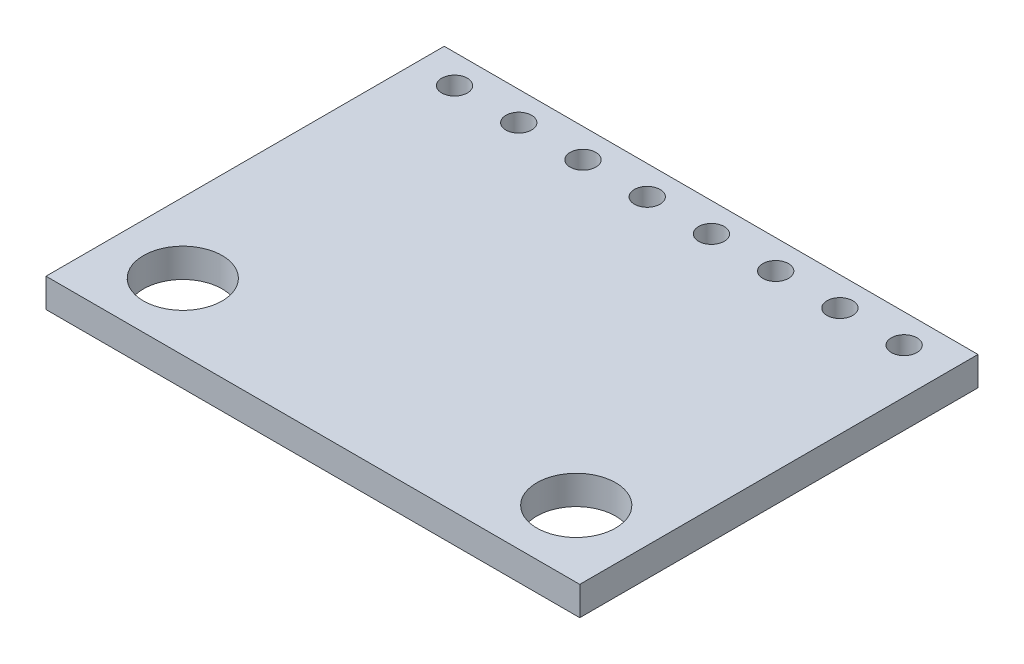
ISO-10303-21;
HEADER;
FILE_DESCRIPTION(('STEP AP214'),'2;1');
FILE_NAME('part.step','',(''),(''),'','','');
FILE_SCHEMA(('AUTOMOTIVE_DESIGN { 1 0 10303 214 1 1 1 1 }'));
ENDSEC;
DATA;
#1=APPLICATION_CONTEXT('core data for automotive mechanical design processes');
#2=APPLICATION_PROTOCOL_DEFINITION('international standard','automotive_design',2000,#1);
#3=PRODUCT_CONTEXT('',#1,'mechanical');
#4=PRODUCT('Part','Part','',(#3));
#5=PRODUCT_RELATED_PRODUCT_CATEGORY('part','',(#4));
#6=PRODUCT_DEFINITION_FORMATION('','',#4);
#7=PRODUCT_DEFINITION_CONTEXT('part definition',#1,'design');
#8=PRODUCT_DEFINITION('design','',#6,#7);
#9=PRODUCT_DEFINITION_SHAPE('','',#8);
#10=(LENGTH_UNIT() NAMED_UNIT(*) SI_UNIT(.MILLI.,.METRE.));
#11=(NAMED_UNIT(*) PLANE_ANGLE_UNIT() SI_UNIT($,.RADIAN.));
#12=(NAMED_UNIT(*) SI_UNIT($,.STERADIAN.) SOLID_ANGLE_UNIT());
#13=UNCERTAINTY_MEASURE_WITH_UNIT(LENGTH_MEASURE(1.E-05),#10,'distance_accuracy_value','');
#14=(GEOMETRIC_REPRESENTATION_CONTEXT(3) GLOBAL_UNCERTAINTY_ASSIGNED_CONTEXT((#13)) GLOBAL_UNIT_ASSIGNED_CONTEXT((#10,
#11,#12)) REPRESENTATION_CONTEXT('',''));
#15=CARTESIAN_POINT('',(0.,0.,0.));
#16=DIRECTION('',(0.,0.,1.));
#17=DIRECTION('',(1.,0.,0.));
#18=AXIS2_PLACEMENT_3D('',#15,#16,#17);
#19=CARTESIAN_POINT('',(0.,0.5715,0.));
#20=DIRECTION('',(0.,-1.,0.));
#21=DIRECTION('',(0.,0.,-1.));
#22=AXIS2_PLACEMENT_3D('',#19,#20,#21);
#23=PLANE('',#22);
#24=CARTESIAN_POINT('',(6.2357,0.5715,-6.731));
#25=DIRECTION('',(0.,1.,0.));
#26=DIRECTION('',(0.,0.,1.));
#27=AXIS2_PLACEMENT_3D('',#24,#25,#26);
#28=CIRCLE('',#27,0.508);
#29=CARTESIAN_POINT('',(6.2357,0.5715,-6.223));
#30=VERTEX_POINT('',#29);
#31=EDGE_CURVE('E158',#30,#30,#28,.T.);
#32=ORIENTED_EDGE('',*,*,#31,.F.);
#33=EDGE_LOOP('',(#32));
#34=FACE_BOUND('',#33,.T.);
#35=CARTESIAN_POINT('',(1.1557,0.5715,-6.731));
#36=DIRECTION('',(0.,1.,0.));
#37=DIRECTION('',(0.,0.,1.));
#38=AXIS2_PLACEMENT_3D('',#35,#36,#37);
#39=CIRCLE('',#38,0.508);
#40=CARTESIAN_POINT('',(1.1557,0.5715,-6.223));
#41=VERTEX_POINT('',#40);
#42=EDGE_CURVE('E146',#41,#41,#39,.T.);
#43=ORIENTED_EDGE('',*,*,#42,.F.);
#44=EDGE_LOOP('',(#43));
#45=FACE_BOUND('',#44,.T.);
#46=CARTESIAN_POINT('',(-3.9243,0.5715,-6.731));
#47=DIRECTION('',(0.,1.,0.));
#48=DIRECTION('',(0.,0.,1.));
#49=AXIS2_PLACEMENT_3D('',#46,#47,#48);
#50=CIRCLE('',#49,0.508);
#51=CARTESIAN_POINT('',(-3.9243,0.5715,-6.223));
#52=VERTEX_POINT('',#51);
#53=EDGE_CURVE('E134',#52,#52,#50,.T.);
#54=ORIENTED_EDGE('',*,*,#53,.F.);
#55=EDGE_LOOP('',(#54));
#56=FACE_BOUND('',#55,.T.);
#57=CARTESIAN_POINT('',(-9.0043,0.5715,-6.731));
#58=DIRECTION('',(0.,1.,0.));
#59=DIRECTION('',(0.,0.,1.));
#60=AXIS2_PLACEMENT_3D('',#57,#58,#59);
#61=CIRCLE('',#60,0.508);
#62=CARTESIAN_POINT('',(-9.0043,0.5715,-6.223));
#63=VERTEX_POINT('',#62);
#64=EDGE_CURVE('E122',#63,#63,#61,.T.);
#65=ORIENTED_EDGE('',*,*,#64,.F.);
#66=EDGE_LOOP('',(#65));
#67=FACE_BOUND('',#66,.T.);
#68=CARTESIAN_POINT('',(-7.77875,0.5715,5.23875));
#69=DIRECTION('',(0.,1.,0.));
#70=DIRECTION('',(0.,0.,1.));
#71=AXIS2_PLACEMENT_3D('',#68,#69,#70);
#72=CIRCLE('',#71,1.55575);
#73=CARTESIAN_POINT('',(-7.77875,0.5715,6.79449999999999));
#74=VERTEX_POINT('',#73);
#75=EDGE_CURVE('E101',#74,#74,#72,.T.);
#76=ORIENTED_EDGE('',*,*,#75,.F.);
#77=EDGE_LOOP('',(#76));
#78=FACE_BOUND('',#77,.T.);
#79=DIRECTION('',(0.,0.,-1.));
#80=VECTOR('',#79,1.);
#81=CARTESIAN_POINT('',(10.5537,0.5715,7.874));
#82=LINE('',#81,#80);
#83=CARTESIAN_POINT('',(10.5537,0.5715,7.874));
#84=VERTEX_POINT('',#83);
#85=CARTESIAN_POINT('',(10.5537,0.5715,-7.874));
#86=VERTEX_POINT('',#85);
#87=EDGE_CURVE('E86',#84,#86,#82,.T.);
#88=ORIENTED_EDGE('',*,*,#87,.T.);
#89=DIRECTION('',(-1.,0.,0.));
#90=VECTOR('',#89,1.);
#91=CARTESIAN_POINT('',(-10.5537,0.5715,-7.874));
#92=LINE('',#91,#90);
#93=CARTESIAN_POINT('',(-10.5537,0.5715,-7.874));
#94=VERTEX_POINT('',#93);
#95=EDGE_CURVE('E81',#86,#94,#92,.T.);
#96=ORIENTED_EDGE('',*,*,#95,.T.);
#97=DIRECTION('',(0.,0.,1.));
#98=VECTOR('',#97,1.);
#99=CARTESIAN_POINT('',(-10.5537,0.5715,7.874));
#100=LINE('',#99,#98);
#101=CARTESIAN_POINT('',(-10.5537,0.5715,7.874));
#102=VERTEX_POINT('',#101);
#103=EDGE_CURVE('E84',#94,#102,#100,.T.);
#104=ORIENTED_EDGE('',*,*,#103,.T.);
#105=DIRECTION('',(1.,0.,0.));
#106=VECTOR('',#105,1.);
#107=CARTESIAN_POINT('',(-10.5537,0.5715,7.874));
#108=LINE('',#107,#106);
#109=EDGE_CURVE('E51',#102,#84,#108,.T.);
#110=ORIENTED_EDGE('',*,*,#109,.T.);
#111=EDGE_LOOP('',(#88,#96,#104,#110));
#112=FACE_BOUND('',#111,.T.);
#113=CARTESIAN_POINT('',(7.77875,0.5715,5.23875));
#114=DIRECTION('',(0.,1.,0.));
#115=DIRECTION('',(0.,0.,-1.));
#116=AXIS2_PLACEMENT_3D('',#113,#114,#115);
#117=CIRCLE('',#116,1.55575);
#118=CARTESIAN_POINT('',(7.77875,0.5715,3.683));
#119=VERTEX_POINT('',#118);
#120=EDGE_CURVE('E116',#119,#119,#117,.T.);
#121=ORIENTED_EDGE('',*,*,#120,.F.);
#122=EDGE_LOOP('',(#121));
#123=FACE_BOUND('',#122,.T.);
#124=CARTESIAN_POINT('',(-6.4643,0.5715,-6.731));
#125=DIRECTION('',(0.,1.,0.));
#126=DIRECTION('',(0.,0.,1.));
#127=AXIS2_PLACEMENT_3D('',#124,#125,#126);
#128=CIRCLE('',#127,0.508);
#129=CARTESIAN_POINT('',(-6.4643,0.5715,-6.223));
#130=VERTEX_POINT('',#129);
#131=EDGE_CURVE('E128',#130,#130,#128,.T.);
#132=ORIENTED_EDGE('',*,*,#131,.F.);
#133=EDGE_LOOP('',(#132));
#134=FACE_BOUND('',#133,.T.);
#135=CARTESIAN_POINT('',(-1.3843,0.5715,-6.731));
#136=DIRECTION('',(0.,1.,0.));
#137=DIRECTION('',(0.,0.,1.));
#138=AXIS2_PLACEMENT_3D('',#135,#136,#137);
#139=CIRCLE('',#138,0.508);
#140=CARTESIAN_POINT('',(-1.3843,0.5715,-6.223));
#141=VERTEX_POINT('',#140);
#142=EDGE_CURVE('E140',#141,#141,#139,.T.);
#143=ORIENTED_EDGE('',*,*,#142,.F.);
#144=EDGE_LOOP('',(#143));
#145=FACE_BOUND('',#144,.T.);
#146=CARTESIAN_POINT('',(3.6957,0.5715,-6.731));
#147=DIRECTION('',(0.,1.,0.));
#148=DIRECTION('',(0.,0.,1.));
#149=AXIS2_PLACEMENT_3D('',#146,#147,#148);
#150=CIRCLE('',#149,0.508);
#151=CARTESIAN_POINT('',(3.6957,0.5715,-6.223));
#152=VERTEX_POINT('',#151);
#153=EDGE_CURVE('E152',#152,#152,#150,.T.);
#154=ORIENTED_EDGE('',*,*,#153,.F.);
#155=EDGE_LOOP('',(#154));
#156=FACE_BOUND('',#155,.T.);
#157=CARTESIAN_POINT('',(8.7757,0.5715,-6.731));
#158=DIRECTION('',(0.,1.,0.));
#159=DIRECTION('',(0.,0.,1.));
#160=AXIS2_PLACEMENT_3D('',#157,#158,#159);
#161=CIRCLE('',#160,0.508);
#162=CARTESIAN_POINT('',(8.7757,0.5715,-6.223));
#163=VERTEX_POINT('',#162);
#164=EDGE_CURVE('E164',#163,#163,#161,.T.);
#165=ORIENTED_EDGE('',*,*,#164,.F.);
#166=EDGE_LOOP('',(#165));
#167=FACE_BOUND('',#166,.T.);
#168=ADVANCED_FACE('F34',(#34,#45,#56,#67,#78,#112,#123,#134,#145,#156,#167),#23,.F.);
#169=CARTESIAN_POINT('',(0.,-0.5715,0.));
#170=DIRECTION('',(0.,-1.,0.));
#171=DIRECTION('',(0.,0.,-1.));
#172=AXIS2_PLACEMENT_3D('',#169,#170,#171);
#173=PLANE('',#172);
#174=CARTESIAN_POINT('',(6.2357,-0.5715,-6.731));
#175=DIRECTION('',(0.,1.,0.));
#176=DIRECTION('',(0.,0.,1.));
#177=AXIS2_PLACEMENT_3D('',#174,#175,#176);
#178=CIRCLE('',#177,0.508);
#179=CARTESIAN_POINT('',(6.2357,-0.5715,-6.223));
#180=VERTEX_POINT('',#179);
#181=EDGE_CURVE('E161',#180,#180,#178,.T.);
#182=ORIENTED_EDGE('',*,*,#181,.T.);
#183=EDGE_LOOP('',(#182));
#184=FACE_BOUND('',#183,.T.);
#185=CARTESIAN_POINT('',(1.1557,-0.5715,-6.731));
#186=DIRECTION('',(0.,1.,0.));
#187=DIRECTION('',(0.,0.,1.));
#188=AXIS2_PLACEMENT_3D('',#185,#186,#187);
#189=CIRCLE('',#188,0.508);
#190=CARTESIAN_POINT('',(1.1557,-0.5715,-6.223));
#191=VERTEX_POINT('',#190);
#192=EDGE_CURVE('E149',#191,#191,#189,.T.);
#193=ORIENTED_EDGE('',*,*,#192,.T.);
#194=EDGE_LOOP('',(#193));
#195=FACE_BOUND('',#194,.T.);
#196=CARTESIAN_POINT('',(-3.9243,-0.5715,-6.731));
#197=DIRECTION('',(0.,1.,0.));
#198=DIRECTION('',(0.,0.,1.));
#199=AXIS2_PLACEMENT_3D('',#196,#197,#198);
#200=CIRCLE('',#199,0.508);
#201=CARTESIAN_POINT('',(-3.9243,-0.5715,-6.223));
#202=VERTEX_POINT('',#201);
#203=EDGE_CURVE('E137',#202,#202,#200,.T.);
#204=ORIENTED_EDGE('',*,*,#203,.T.);
#205=EDGE_LOOP('',(#204));
#206=FACE_BOUND('',#205,.T.);
#207=CARTESIAN_POINT('',(-9.0043,-0.5715,-6.731));
#208=DIRECTION('',(0.,1.,0.));
#209=DIRECTION('',(0.,0.,1.));
#210=AXIS2_PLACEMENT_3D('',#207,#208,#209);
#211=CIRCLE('',#210,0.508);
#212=CARTESIAN_POINT('',(-9.0043,-0.5715,-6.223));
#213=VERTEX_POINT('',#212);
#214=EDGE_CURVE('E125',#213,#213,#211,.T.);
#215=ORIENTED_EDGE('',*,*,#214,.T.);
#216=EDGE_LOOP('',(#215));
#217=FACE_BOUND('',#216,.T.);
#218=CARTESIAN_POINT('',(-7.77875,-0.5715,5.23875));
#219=DIRECTION('',(0.,1.,0.));
#220=DIRECTION('',(0.,0.,1.));
#221=AXIS2_PLACEMENT_3D('',#218,#219,#220);
#222=CIRCLE('',#221,1.55575);
#223=CARTESIAN_POINT('',(-7.77875,-0.5715,6.79449999999999));
#224=VERTEX_POINT('',#223);
#225=EDGE_CURVE('E113',#224,#224,#222,.T.);
#226=ORIENTED_EDGE('',*,*,#225,.T.);
#227=EDGE_LOOP('',(#226));
#228=FACE_BOUND('',#227,.T.);
#229=DIRECTION('',(0.,0.,-1.));
#230=VECTOR('',#229,1.);
#231=CARTESIAN_POINT('',(10.5537,-0.5715,7.874));
#232=LINE('',#231,#230);
#233=CARTESIAN_POINT('',(10.5537,-0.5715,7.874));
#234=VERTEX_POINT('',#233);
#235=CARTESIAN_POINT('',(10.5537,-0.5715,-7.874));
#236=VERTEX_POINT('',#235);
#237=EDGE_CURVE('E98',#234,#236,#232,.T.);
#238=ORIENTED_EDGE('',*,*,#237,.F.);
#239=DIRECTION('',(1.,0.,0.));
#240=VECTOR('',#239,1.);
#241=CARTESIAN_POINT('',(-10.5537,-0.5715,7.874));
#242=LINE('',#241,#240);
#243=CARTESIAN_POINT('',(-10.5537,-0.5715,7.874));
#244=VERTEX_POINT('',#243);
#245=EDGE_CURVE('E74',#244,#234,#242,.T.);
#246=ORIENTED_EDGE('',*,*,#245,.F.);
#247=DIRECTION('',(0.,0.,1.));
#248=VECTOR('',#247,1.);
#249=CARTESIAN_POINT('',(-10.5537,-0.5715,7.874));
#250=LINE('',#249,#248);
#251=CARTESIAN_POINT('',(-10.5537,-0.5715,-7.874));
#252=VERTEX_POINT('',#251);
#253=EDGE_CURVE('E68',#252,#244,#250,.T.);
#254=ORIENTED_EDGE('',*,*,#253,.F.);
#255=DIRECTION('',(-1.,0.,0.));
#256=VECTOR('',#255,1.);
#257=CARTESIAN_POINT('',(-10.5537,-0.5715,-7.874));
#258=LINE('',#257,#256);
#259=EDGE_CURVE('E90',#236,#252,#258,.T.);
#260=ORIENTED_EDGE('',*,*,#259,.F.);
#261=EDGE_LOOP('',(#238,#246,#254,#260));
#262=FACE_BOUND('',#261,.T.);
#263=CARTESIAN_POINT('',(7.77875,-0.5715,5.23875));
#264=DIRECTION('',(0.,1.,0.));
#265=DIRECTION('',(0.,0.,-1.));
#266=AXIS2_PLACEMENT_3D('',#263,#264,#265);
#267=CIRCLE('',#266,1.55575);
#268=CARTESIAN_POINT('',(7.77875,-0.5715,3.683));
#269=VERTEX_POINT('',#268);
#270=EDGE_CURVE('E119',#269,#269,#267,.T.);
#271=ORIENTED_EDGE('',*,*,#270,.T.);
#272=EDGE_LOOP('',(#271));
#273=FACE_BOUND('',#272,.T.);
#274=CARTESIAN_POINT('',(-6.4643,-0.5715,-6.731));
#275=DIRECTION('',(0.,1.,0.));
#276=DIRECTION('',(0.,0.,1.));
#277=AXIS2_PLACEMENT_3D('',#274,#275,#276);
#278=CIRCLE('',#277,0.508);
#279=CARTESIAN_POINT('',(-6.4643,-0.5715,-6.223));
#280=VERTEX_POINT('',#279);
#281=EDGE_CURVE('E131',#280,#280,#278,.T.);
#282=ORIENTED_EDGE('',*,*,#281,.T.);
#283=EDGE_LOOP('',(#282));
#284=FACE_BOUND('',#283,.T.);
#285=CARTESIAN_POINT('',(-1.3843,-0.5715,-6.731));
#286=DIRECTION('',(0.,1.,0.));
#287=DIRECTION('',(0.,0.,1.));
#288=AXIS2_PLACEMENT_3D('',#285,#286,#287);
#289=CIRCLE('',#288,0.508);
#290=CARTESIAN_POINT('',(-1.3843,-0.5715,-6.223));
#291=VERTEX_POINT('',#290);
#292=EDGE_CURVE('E143',#291,#291,#289,.T.);
#293=ORIENTED_EDGE('',*,*,#292,.T.);
#294=EDGE_LOOP('',(#293));
#295=FACE_BOUND('',#294,.T.);
#296=CARTESIAN_POINT('',(3.6957,-0.5715,-6.731));
#297=DIRECTION('',(0.,1.,0.));
#298=DIRECTION('',(0.,0.,1.));
#299=AXIS2_PLACEMENT_3D('',#296,#297,#298);
#300=CIRCLE('',#299,0.508);
#301=CARTESIAN_POINT('',(3.6957,-0.5715,-6.223));
#302=VERTEX_POINT('',#301);
#303=EDGE_CURVE('E155',#302,#302,#300,.T.);
#304=ORIENTED_EDGE('',*,*,#303,.T.);
#305=EDGE_LOOP('',(#304));
#306=FACE_BOUND('',#305,.T.);
#307=CARTESIAN_POINT('',(8.7757,-0.5715,-6.731));
#308=DIRECTION('',(0.,1.,0.));
#309=DIRECTION('',(0.,0.,1.));
#310=AXIS2_PLACEMENT_3D('',#307,#308,#309);
#311=CIRCLE('',#310,0.508);
#312=CARTESIAN_POINT('',(8.7757,-0.5715,-6.223));
#313=VERTEX_POINT('',#312);
#314=EDGE_CURVE('E167',#313,#313,#311,.T.);
#315=ORIENTED_EDGE('',*,*,#314,.T.);
#316=EDGE_LOOP('',(#315));
#317=FACE_BOUND('',#316,.T.);
#318=ADVANCED_FACE('F109',(#184,#195,#206,#217,#228,#262,#273,#284,#295,#306,#317),#173,.T.);
#319=CARTESIAN_POINT('',(10.5537,0.5715,7.874));
#320=DIRECTION('',(-1.,0.,0.));
#321=DIRECTION('',(0.,0.,1.));
#322=AXIS2_PLACEMENT_3D('',#319,#320,#321);
#323=PLANE('',#322);
#324=ORIENTED_EDGE('',*,*,#237,.T.);
#325=DIRECTION('',(0.,-1.,0.));
#326=VECTOR('',#325,1.);
#327=CARTESIAN_POINT('',(10.5537,0.5715,-7.874));
#328=LINE('',#327,#326);
#329=EDGE_CURVE('E11',#86,#236,#328,.T.);
#330=ORIENTED_EDGE('',*,*,#329,.F.);
#331=ORIENTED_EDGE('',*,*,#87,.F.);
#332=DIRECTION('',(0.,-1.,0.));
#333=VECTOR('',#332,1.);
#334=CARTESIAN_POINT('',(10.5537,0.5715,7.874));
#335=LINE('',#334,#333);
#336=EDGE_CURVE('E94',#84,#234,#335,.T.);
#337=ORIENTED_EDGE('',*,*,#336,.T.);
#338=EDGE_LOOP('',(#324,#330,#331,#337));
#339=FACE_BOUND('',#338,.T.);
#340=ADVANCED_FACE('F36',(#339),#323,.F.);
#341=CARTESIAN_POINT('',(-10.5537,0.5715,-7.874));
#342=DIRECTION('',(0.,0.,1.));
#343=DIRECTION('',(1.,0.,0.));
#344=AXIS2_PLACEMENT_3D('',#341,#342,#343);
#345=PLANE('',#344);
#346=ORIENTED_EDGE('',*,*,#259,.T.);
#347=DIRECTION('',(0.,-1.,0.));
#348=VECTOR('',#347,1.);
#349=CARTESIAN_POINT('',(-10.5537,0.5715,-7.874));
#350=LINE('',#349,#348);
#351=EDGE_CURVE('E43',#94,#252,#350,.T.);
#352=ORIENTED_EDGE('',*,*,#351,.F.);
#353=ORIENTED_EDGE('',*,*,#95,.F.);
#354=ORIENTED_EDGE('',*,*,#329,.T.);
#355=EDGE_LOOP('',(#346,#352,#353,#354));
#356=FACE_BOUND('',#355,.T.);
#357=ADVANCED_FACE('F89',(#356),#345,.F.);
#358=CARTESIAN_POINT('',(-10.5537,0.5715,7.874));
#359=DIRECTION('',(1.,0.,0.));
#360=DIRECTION('',(0.,0.,-1.));
#361=AXIS2_PLACEMENT_3D('',#358,#359,#360);
#362=PLANE('',#361);
#363=ORIENTED_EDGE('',*,*,#253,.T.);
#364=DIRECTION('',(0.,-1.,0.));
#365=VECTOR('',#364,1.);
#366=CARTESIAN_POINT('',(-10.5537,0.5715,7.874));
#367=LINE('',#366,#365);
#368=EDGE_CURVE('E91',#102,#244,#367,.T.);
#369=ORIENTED_EDGE('',*,*,#368,.F.);
#370=ORIENTED_EDGE('',*,*,#103,.F.);
#371=ORIENTED_EDGE('',*,*,#351,.T.);
#372=EDGE_LOOP('',(#363,#369,#370,#371));
#373=FACE_BOUND('',#372,.T.);
#374=ADVANCED_FACE('F92',(#373),#362,.F.);
#375=CARTESIAN_POINT('',(-10.5537,0.5715,7.874));
#376=DIRECTION('',(0.,0.,-1.));
#377=DIRECTION('',(-1.,0.,0.));
#378=AXIS2_PLACEMENT_3D('',#375,#376,#377);
#379=PLANE('',#378);
#380=ORIENTED_EDGE('',*,*,#245,.T.);
#381=ORIENTED_EDGE('',*,*,#336,.F.);
#382=ORIENTED_EDGE('',*,*,#109,.F.);
#383=ORIENTED_EDGE('',*,*,#368,.T.);
#384=EDGE_LOOP('',(#380,#381,#382,#383));
#385=FACE_BOUND('',#384,.T.);
#386=ADVANCED_FACE('F106',(#385),#379,.F.);
#387=CARTESIAN_POINT('',(-7.77875,0.5715,5.23875));
#388=DIRECTION('',(0.,-1.,0.));
#389=DIRECTION('',(0.,0.,-1.));
#390=AXIS2_PLACEMENT_3D('',#387,#388,#389);
#391=CYLINDRICAL_SURFACE('',#390,1.55575);
#392=ORIENTED_EDGE('',*,*,#75,.T.);
#393=EDGE_LOOP('',(#392));
#394=FACE_BOUND('',#393,.T.);
#395=ORIENTED_EDGE('',*,*,#225,.F.);
#396=EDGE_LOOP('',(#395));
#397=FACE_BOUND('',#396,.T.);
#398=ADVANCED_FACE('F187',(#394,#397),#391,.F.);
#399=CARTESIAN_POINT('',(7.77875,0.5715,5.23875));
#400=DIRECTION('',(0.,-1.,0.));
#401=DIRECTION('',(0.,0.,-1.));
#402=AXIS2_PLACEMENT_3D('',#399,#400,#401);
#403=CYLINDRICAL_SURFACE('',#402,1.55575);
#404=ORIENTED_EDGE('',*,*,#120,.T.);
#405=EDGE_LOOP('',(#404));
#406=FACE_BOUND('',#405,.T.);
#407=ORIENTED_EDGE('',*,*,#270,.F.);
#408=EDGE_LOOP('',(#407));
#409=FACE_BOUND('',#408,.T.);
#410=ADVANCED_FACE('F211',(#406,#409),#403,.F.);
#411=CARTESIAN_POINT('',(-9.0043,0.5715,-6.731));
#412=DIRECTION('',(0.,-1.,0.));
#413=DIRECTION('',(0.,0.,-1.));
#414=AXIS2_PLACEMENT_3D('',#411,#412,#413);
#415=CYLINDRICAL_SURFACE('',#414,0.508);
#416=ORIENTED_EDGE('',*,*,#64,.T.);
#417=EDGE_LOOP('',(#416));
#418=FACE_BOUND('',#417,.T.);
#419=ORIENTED_EDGE('',*,*,#214,.F.);
#420=EDGE_LOOP('',(#419));
#421=FACE_BOUND('',#420,.T.);
#422=ADVANCED_FACE('F216',(#418,#421),#415,.F.);
#423=CARTESIAN_POINT('',(-6.4643,0.5715,-6.731));
#424=DIRECTION('',(0.,-1.,0.));
#425=DIRECTION('',(0.,0.,-1.));
#426=AXIS2_PLACEMENT_3D('',#423,#424,#425);
#427=CYLINDRICAL_SURFACE('',#426,0.508);
#428=ORIENTED_EDGE('',*,*,#131,.T.);
#429=EDGE_LOOP('',(#428));
#430=FACE_BOUND('',#429,.T.);
#431=ORIENTED_EDGE('',*,*,#281,.F.);
#432=EDGE_LOOP('',(#431));
#433=FACE_BOUND('',#432,.T.);
#434=ADVANCED_FACE('F234',(#430,#433),#427,.F.);
#435=CARTESIAN_POINT('',(-3.9243,0.5715,-6.731));
#436=DIRECTION('',(0.,-1.,0.));
#437=DIRECTION('',(0.,0.,-1.));
#438=AXIS2_PLACEMENT_3D('',#435,#436,#437);
#439=CYLINDRICAL_SURFACE('',#438,0.508);
#440=ORIENTED_EDGE('',*,*,#53,.T.);
#441=EDGE_LOOP('',(#440));
#442=FACE_BOUND('',#441,.T.);
#443=ORIENTED_EDGE('',*,*,#203,.F.);
#444=EDGE_LOOP('',(#443));
#445=FACE_BOUND('',#444,.T.);
#446=ADVANCED_FACE('F244',(#442,#445),#439,.F.);
#447=CARTESIAN_POINT('',(-1.3843,0.5715,-6.731));
#448=DIRECTION('',(0.,-1.,0.));
#449=DIRECTION('',(0.,0.,-1.));
#450=AXIS2_PLACEMENT_3D('',#447,#448,#449);
#451=CYLINDRICAL_SURFACE('',#450,0.508);
#452=ORIENTED_EDGE('',*,*,#142,.T.);
#453=EDGE_LOOP('',(#452));
#454=FACE_BOUND('',#453,.T.);
#455=ORIENTED_EDGE('',*,*,#292,.F.);
#456=EDGE_LOOP('',(#455));
#457=FACE_BOUND('',#456,.T.);
#458=ADVANCED_FACE('F254',(#454,#457),#451,.F.);
#459=CARTESIAN_POINT('',(1.1557,0.5715,-6.731));
#460=DIRECTION('',(0.,-1.,0.));
#461=DIRECTION('',(0.,0.,-1.));
#462=AXIS2_PLACEMENT_3D('',#459,#460,#461);
#463=CYLINDRICAL_SURFACE('',#462,0.508);
#464=ORIENTED_EDGE('',*,*,#42,.T.);
#465=EDGE_LOOP('',(#464));
#466=FACE_BOUND('',#465,.T.);
#467=ORIENTED_EDGE('',*,*,#192,.F.);
#468=EDGE_LOOP('',(#467));
#469=FACE_BOUND('',#468,.T.);
#470=ADVANCED_FACE('F264',(#466,#469),#463,.F.);
#471=CARTESIAN_POINT('',(3.6957,0.5715,-6.731));
#472=DIRECTION('',(0.,-1.,0.));
#473=DIRECTION('',(0.,0.,-1.));
#474=AXIS2_PLACEMENT_3D('',#471,#472,#473);
#475=CYLINDRICAL_SURFACE('',#474,0.508);
#476=ORIENTED_EDGE('',*,*,#153,.T.);
#477=EDGE_LOOP('',(#476));
#478=FACE_BOUND('',#477,.T.);
#479=ORIENTED_EDGE('',*,*,#303,.F.);
#480=EDGE_LOOP('',(#479));
#481=FACE_BOUND('',#480,.T.);
#482=ADVANCED_FACE('F274',(#478,#481),#475,.F.);
#483=CARTESIAN_POINT('',(6.2357,0.5715,-6.731));
#484=DIRECTION('',(0.,-1.,0.));
#485=DIRECTION('',(0.,0.,-1.));
#486=AXIS2_PLACEMENT_3D('',#483,#484,#485);
#487=CYLINDRICAL_SURFACE('',#486,0.508);
#488=ORIENTED_EDGE('',*,*,#31,.T.);
#489=EDGE_LOOP('',(#488));
#490=FACE_BOUND('',#489,.T.);
#491=ORIENTED_EDGE('',*,*,#181,.F.);
#492=EDGE_LOOP('',(#491));
#493=FACE_BOUND('',#492,.T.);
#494=ADVANCED_FACE('F284',(#490,#493),#487,.F.);
#495=CARTESIAN_POINT('',(8.7757,0.5715,-6.731));
#496=DIRECTION('',(0.,-1.,0.));
#497=DIRECTION('',(0.,0.,-1.));
#498=AXIS2_PLACEMENT_3D('',#495,#496,#497);
#499=CYLINDRICAL_SURFACE('',#498,0.508);
#500=ORIENTED_EDGE('',*,*,#164,.T.);
#501=EDGE_LOOP('',(#500));
#502=FACE_BOUND('',#501,.T.);
#503=ORIENTED_EDGE('',*,*,#314,.F.);
#504=EDGE_LOOP('',(#503));
#505=FACE_BOUND('',#504,.T.);
#506=ADVANCED_FACE('F173',(#502,#505),#499,.F.);
#507=CLOSED_SHELL('',(#168,#318,#340,#357,#374,#386,#398,#410,#422,#434,#446,#458,#470,#482,
#494,#506));
#508=MANIFOLD_SOLID_BREP('B2',#507);
#509=ADVANCED_BREP_SHAPE_REPRESENTATION('',(#18,#508),#14);
#510=SHAPE_DEFINITION_REPRESENTATION(#9,#509);
ENDSEC;
END-ISO-10303-21;
